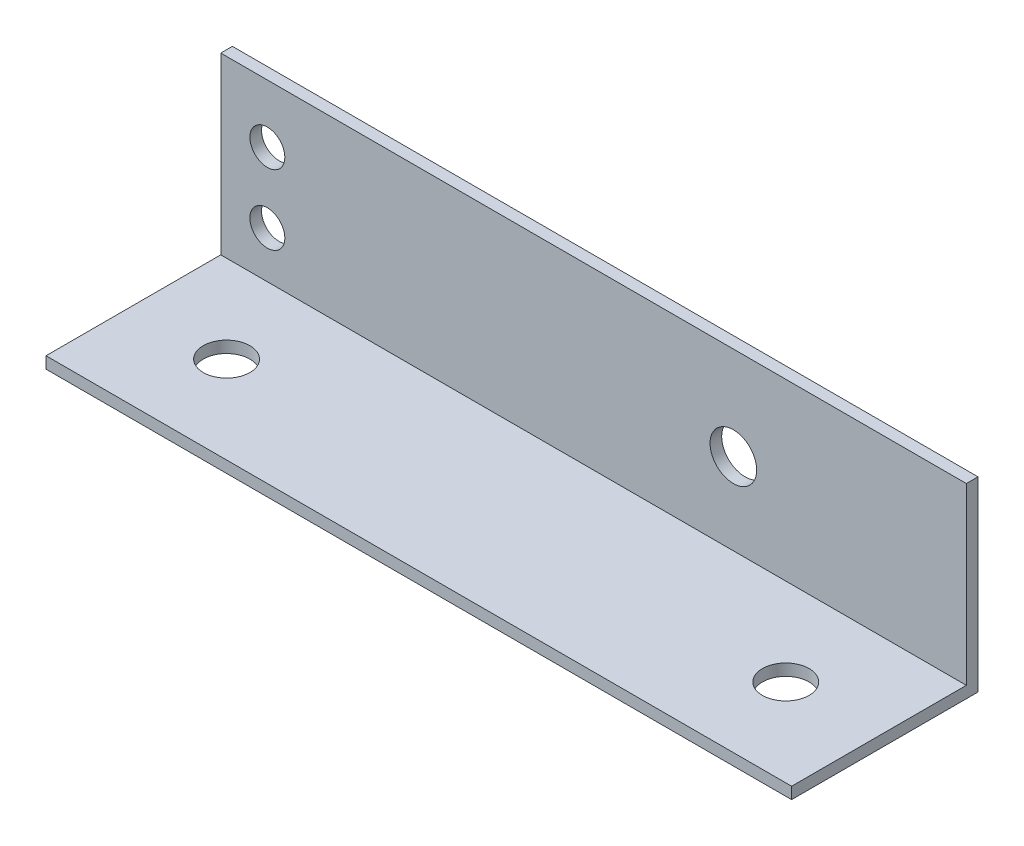
ISO-10303-21;
HEADER;
FILE_DESCRIPTION(('STEP AP214'),'2;1');
FILE_NAME('part.step','',(''),(''),'','','');
FILE_SCHEMA(('AUTOMOTIVE_DESIGN { 1 0 10303 214 1 1 1 1 }'));
ENDSEC;
DATA;
#1=APPLICATION_CONTEXT('core data for automotive mechanical design processes');
#2=APPLICATION_PROTOCOL_DEFINITION('international standard','automotive_design',2000,#1);
#3=PRODUCT_CONTEXT('',#1,'mechanical');
#4=PRODUCT('Part','Part','',(#3));
#5=PRODUCT_RELATED_PRODUCT_CATEGORY('part','',(#4));
#6=PRODUCT_DEFINITION_FORMATION('','',#4);
#7=PRODUCT_DEFINITION_CONTEXT('part definition',#1,'design');
#8=PRODUCT_DEFINITION('design','',#6,#7);
#9=PRODUCT_DEFINITION_SHAPE('','',#8);
#10=(LENGTH_UNIT() NAMED_UNIT(*) SI_UNIT(.MILLI.,.METRE.));
#11=(NAMED_UNIT(*) PLANE_ANGLE_UNIT() SI_UNIT($,.RADIAN.));
#12=(NAMED_UNIT(*) SI_UNIT($,.STERADIAN.) SOLID_ANGLE_UNIT());
#13=UNCERTAINTY_MEASURE_WITH_UNIT(LENGTH_MEASURE(1.E-05),#10,'distance_accuracy_value','');
#14=(GEOMETRIC_REPRESENTATION_CONTEXT(3) GLOBAL_UNCERTAINTY_ASSIGNED_CONTEXT((#13)) GLOBAL_UNIT_ASSIGNED_CONTEXT((#10,
#11,#12)) REPRESENTATION_CONTEXT('',''));
#15=CARTESIAN_POINT('',(0.,0.,0.));
#16=DIRECTION('',(0.,0.,1.));
#17=DIRECTION('',(1.,0.,0.));
#18=AXIS2_PLACEMENT_3D('',#15,#16,#17);
#19=CARTESIAN_POINT('',(101.6,0.,25.4));
#20=DIRECTION('',(0.,1.,0.));
#21=DIRECTION('',(0.,0.,1.));
#22=AXIS2_PLACEMENT_3D('',#19,#20,#21);
#23=PLANE('',#22);
#24=CARTESIAN_POINT('',(12.7,0.,13.49375));
#25=DIRECTION('',(0.,1.,0.));
#26=DIRECTION('',(0.,0.,1.));
#27=AXIS2_PLACEMENT_3D('',#24,#25,#26);
#28=CIRCLE('',#27,3.175);
#29=CARTESIAN_POINT('',(12.7,0.,16.66875));
#30=VERTEX_POINT('',#29);
#31=EDGE_CURVE('E124',#30,#30,#28,.T.);
#32=ORIENTED_EDGE('',*,*,#31,.T.);
#33=EDGE_LOOP('',(#32));
#34=FACE_BOUND('',#33,.T.);
#35=CARTESIAN_POINT('',(88.9,0.,13.49375));
#36=DIRECTION('',(0.,1.,0.));
#37=DIRECTION('',(0.,0.,1.));
#38=AXIS2_PLACEMENT_3D('',#35,#36,#37);
#39=CIRCLE('',#38,3.175);
#40=CARTESIAN_POINT('',(88.9,0.,16.66875));
#41=VERTEX_POINT('',#40);
#42=EDGE_CURVE('E167',#41,#41,#39,.T.);
#43=ORIENTED_EDGE('',*,*,#42,.T.);
#44=EDGE_LOOP('',(#43));
#45=FACE_BOUND('',#44,.T.);
#46=DIRECTION('',(0.,0.,-1.));
#47=VECTOR('',#46,1.);
#48=CARTESIAN_POINT('',(0.,0.,25.4));
#49=LINE('',#48,#47);
#50=CARTESIAN_POINT('',(0.,0.,25.4));
#51=VERTEX_POINT('',#50);
#52=CARTESIAN_POINT('',(0.,0.,0.));
#53=VERTEX_POINT('',#52);
#54=EDGE_CURVE('E120',#51,#53,#49,.T.);
#55=ORIENTED_EDGE('',*,*,#54,.T.);
#56=DIRECTION('',(-1.,0.,0.));
#57=VECTOR('',#56,1.);
#58=CARTESIAN_POINT('',(101.6,0.,0.));
#59=LINE('',#58,#57);
#60=CARTESIAN_POINT('',(101.6,0.,0.));
#61=VERTEX_POINT('',#60);
#62=EDGE_CURVE('E11',#61,#53,#59,.T.);
#63=ORIENTED_EDGE('',*,*,#62,.F.);
#64=DIRECTION('',(0.,0.,-1.));
#65=VECTOR('',#64,1.);
#66=CARTESIAN_POINT('',(101.6,0.,25.4));
#67=LINE('',#66,#65);
#68=CARTESIAN_POINT('',(101.6,0.,25.4));
#69=VERTEX_POINT('',#68);
#70=EDGE_CURVE('E131',#69,#61,#67,.T.);
#71=ORIENTED_EDGE('',*,*,#70,.F.);
#72=DIRECTION('',(-1.,0.,0.));
#73=VECTOR('',#72,1.);
#74=CARTESIAN_POINT('',(101.6,0.,25.4));
#75=LINE('',#74,#73);
#76=EDGE_CURVE('E116',#69,#51,#75,.T.);
#77=ORIENTED_EDGE('',*,*,#76,.T.);
#78=EDGE_LOOP('',(#55,#63,#71,#77));
#79=FACE_BOUND('',#78,.T.);
#80=ADVANCED_FACE('F36',(#34,#45,#79),#23,.F.);
#81=CARTESIAN_POINT('',(101.6,0.,0.));
#82=DIRECTION('',(0.,0.,1.));
#83=DIRECTION('',(1.,0.,0.));
#84=AXIS2_PLACEMENT_3D('',#81,#82,#83);
#85=PLANE('',#84);
#86=CARTESIAN_POINT('',(69.85,12.7,0.));
#87=DIRECTION('',(0.,0.,1.));
#88=DIRECTION('',(1.,0.,0.));
#89=AXIS2_PLACEMENT_3D('',#86,#87,#88);
#90=CIRCLE('',#89,3.175);
#91=CARTESIAN_POINT('',(73.025,12.7,0.));
#92=VERTEX_POINT('',#91);
#93=EDGE_CURVE('E179',#92,#92,#90,.T.);
#94=ORIENTED_EDGE('',*,*,#93,.T.);
#95=EDGE_LOOP('',(#94));
#96=FACE_BOUND('',#95,.T.);
#97=CARTESIAN_POINT('',(6.35,17.4625,0.));
#98=DIRECTION('',(0.,0.,1.));
#99=DIRECTION('',(1.,0.,0.));
#100=AXIS2_PLACEMENT_3D('',#97,#98,#99);
#101=CIRCLE('',#100,2.38125);
#102=CARTESIAN_POINT('',(8.73125,17.4625,0.));
#103=VERTEX_POINT('',#102);
#104=EDGE_CURVE('E183',#103,#103,#101,.T.);
#105=ORIENTED_EDGE('',*,*,#104,.T.);
#106=EDGE_LOOP('',(#105));
#107=FACE_BOUND('',#106,.T.);
#108=CARTESIAN_POINT('',(6.35,7.9375,0.));
#109=DIRECTION('',(0.,0.,1.));
#110=DIRECTION('',(1.,0.,0.));
#111=AXIS2_PLACEMENT_3D('',#108,#109,#110);
#112=CIRCLE('',#111,2.38125);
#113=CARTESIAN_POINT('',(8.73125,7.9375,0.));
#114=VERTEX_POINT('',#113);
#115=EDGE_CURVE('E186',#114,#114,#112,.T.);
#116=ORIENTED_EDGE('',*,*,#115,.T.);
#117=EDGE_LOOP('',(#116));
#118=FACE_BOUND('',#117,.T.);
#119=DIRECTION('',(0.,1.,0.));
#120=VECTOR('',#119,1.);
#121=CARTESIAN_POINT('',(0.,0.,0.));
#122=LINE('',#121,#120);
#123=CARTESIAN_POINT('',(0.,25.4,0.));
#124=VERTEX_POINT('',#123);
#125=EDGE_CURVE('E123',#53,#124,#122,.T.);
#126=ORIENTED_EDGE('',*,*,#125,.T.);
#127=DIRECTION('',(-1.,0.,0.));
#128=VECTOR('',#127,1.);
#129=CARTESIAN_POINT('',(101.6,25.4,0.));
#130=LINE('',#129,#128);
#131=CARTESIAN_POINT('',(101.6,25.4,0.));
#132=VERTEX_POINT('',#131);
#133=EDGE_CURVE('E44',#132,#124,#130,.T.);
#134=ORIENTED_EDGE('',*,*,#133,.F.);
#135=DIRECTION('',(0.,1.,0.));
#136=VECTOR('',#135,1.);
#137=CARTESIAN_POINT('',(101.6,0.,0.));
#138=LINE('',#137,#136);
#139=EDGE_CURVE('E89',#61,#132,#138,.T.);
#140=ORIENTED_EDGE('',*,*,#139,.F.);
#141=ORIENTED_EDGE('',*,*,#62,.T.);
#142=EDGE_LOOP('',(#126,#134,#140,#141));
#143=FACE_BOUND('',#142,.T.);
#144=ADVANCED_FACE('F156',(#96,#107,#118,#143),#85,.F.);
#145=CARTESIAN_POINT('',(101.6,25.4,0.));
#146=DIRECTION('',(0.,-1.,0.));
#147=DIRECTION('',(0.,0.,-1.));
#148=AXIS2_PLACEMENT_3D('',#145,#146,#147);
#149=PLANE('',#148);
#150=DIRECTION('',(0.,0.,1.));
#151=VECTOR('',#150,1.);
#152=CARTESIAN_POINT('',(0.,25.4,0.));
#153=LINE('',#152,#151);
#154=CARTESIAN_POINT('',(0.,25.4,1.5875));
#155=VERTEX_POINT('',#154);
#156=EDGE_CURVE('E126',#124,#155,#153,.T.);
#157=ORIENTED_EDGE('',*,*,#156,.T.);
#158=DIRECTION('',(-1.,0.,0.));
#159=VECTOR('',#158,1.);
#160=CARTESIAN_POINT('',(101.6,25.4,1.5875));
#161=LINE('',#160,#159);
#162=CARTESIAN_POINT('',(101.6,25.4,1.5875));
#163=VERTEX_POINT('',#162);
#164=EDGE_CURVE('E111',#163,#155,#161,.T.);
#165=ORIENTED_EDGE('',*,*,#164,.F.);
#166=DIRECTION('',(0.,0.,1.));
#167=VECTOR('',#166,1.);
#168=CARTESIAN_POINT('',(101.6,25.4,0.));
#169=LINE('',#168,#167);
#170=EDGE_CURVE('E102',#132,#163,#169,.T.);
#171=ORIENTED_EDGE('',*,*,#170,.F.);
#172=ORIENTED_EDGE('',*,*,#133,.T.);
#173=EDGE_LOOP('',(#157,#165,#171,#172));
#174=FACE_BOUND('',#173,.T.);
#175=ADVANCED_FACE('F137',(#174),#149,.F.);
#176=CARTESIAN_POINT('',(101.6,25.4,1.5875));
#177=DIRECTION('',(0.,0.,-1.));
#178=DIRECTION('',(0.,1.,0.));
#179=AXIS2_PLACEMENT_3D('',#176,#177,#178);
#180=PLANE('',#179);
#181=CARTESIAN_POINT('',(69.85,12.7,1.5875));
#182=DIRECTION('',(0.,0.,1.));
#183=DIRECTION('',(1.,0.,0.));
#184=AXIS2_PLACEMENT_3D('',#181,#182,#183);
#185=CIRCLE('',#184,3.175);
#186=CARTESIAN_POINT('',(73.025,12.7,1.5875));
#187=VERTEX_POINT('',#186);
#188=EDGE_CURVE('E189',#187,#187,#185,.T.);
#189=ORIENTED_EDGE('',*,*,#188,.F.);
#190=EDGE_LOOP('',(#189));
#191=FACE_BOUND('',#190,.T.);
#192=CARTESIAN_POINT('',(6.35,17.4625,1.5875));
#193=DIRECTION('',(0.,0.,1.));
#194=DIRECTION('',(1.,0.,0.));
#195=AXIS2_PLACEMENT_3D('',#192,#193,#194);
#196=CIRCLE('',#195,2.38125);
#197=CARTESIAN_POINT('',(8.73125,17.4625,1.5875));
#198=VERTEX_POINT('',#197);
#199=EDGE_CURVE('E193',#198,#198,#196,.T.);
#200=ORIENTED_EDGE('',*,*,#199,.F.);
#201=EDGE_LOOP('',(#200));
#202=FACE_BOUND('',#201,.T.);
#203=CARTESIAN_POINT('',(6.35,7.9375,1.5875));
#204=DIRECTION('',(0.,0.,1.));
#205=DIRECTION('',(1.,0.,0.));
#206=AXIS2_PLACEMENT_3D('',#203,#204,#205);
#207=CIRCLE('',#206,2.38125);
#208=CARTESIAN_POINT('',(8.73125,7.9375,1.5875));
#209=VERTEX_POINT('',#208);
#210=EDGE_CURVE('E190',#209,#209,#207,.T.);
#211=ORIENTED_EDGE('',*,*,#210,.F.);
#212=EDGE_LOOP('',(#211));
#213=FACE_BOUND('',#212,.T.);
#214=DIRECTION('',(0.,-1.,0.));
#215=VECTOR('',#214,1.);
#216=CARTESIAN_POINT('',(0.,25.4,1.5875));
#217=LINE('',#216,#215);
#218=CARTESIAN_POINT('',(0.,1.5875,1.5875));
#219=VERTEX_POINT('',#218);
#220=EDGE_CURVE('E110',#155,#219,#217,.T.);
#221=ORIENTED_EDGE('',*,*,#220,.T.);
#222=DIRECTION('',(-1.,0.,0.));
#223=VECTOR('',#222,1.);
#224=CARTESIAN_POINT('',(101.6,1.5875,1.5875));
#225=LINE('',#224,#223);
#226=CARTESIAN_POINT('',(101.6,1.5875,1.5875));
#227=VERTEX_POINT('',#226);
#228=EDGE_CURVE('E107',#227,#219,#225,.T.);
#229=ORIENTED_EDGE('',*,*,#228,.F.);
#230=DIRECTION('',(0.,-1.,0.));
#231=VECTOR('',#230,1.);
#232=CARTESIAN_POINT('',(101.6,25.4,1.5875));
#233=LINE('',#232,#231);
#234=EDGE_CURVE('E96',#163,#227,#233,.T.);
#235=ORIENTED_EDGE('',*,*,#234,.F.);
#236=ORIENTED_EDGE('',*,*,#164,.T.);
#237=EDGE_LOOP('',(#221,#229,#235,#236));
#238=FACE_BOUND('',#237,.T.);
#239=ADVANCED_FACE('F108',(#191,#202,#213,#238),#180,.F.);
#240=CARTESIAN_POINT('',(101.6,1.5875,1.5875));
#241=DIRECTION('',(0.,-1.,0.));
#242=DIRECTION('',(0.,0.,-1.));
#243=AXIS2_PLACEMENT_3D('',#240,#241,#242);
#244=PLANE('',#243);
#245=CARTESIAN_POINT('',(12.7,1.5875,13.49375));
#246=DIRECTION('',(0.,1.,0.));
#247=DIRECTION('',(0.,0.,1.));
#248=AXIS2_PLACEMENT_3D('',#245,#246,#247);
#249=CIRCLE('',#248,3.175);
#250=CARTESIAN_POINT('',(12.7,1.5875,16.66875));
#251=VERTEX_POINT('',#250);
#252=EDGE_CURVE('E169',#251,#251,#249,.T.);
#253=ORIENTED_EDGE('',*,*,#252,.F.);
#254=EDGE_LOOP('',(#253));
#255=FACE_BOUND('',#254,.T.);
#256=CARTESIAN_POINT('',(88.9,1.5875,13.49375));
#257=DIRECTION('',(0.,1.,0.));
#258=DIRECTION('',(0.,0.,1.));
#259=AXIS2_PLACEMENT_3D('',#256,#257,#258);
#260=CIRCLE('',#259,3.175);
#261=CARTESIAN_POINT('',(88.9,1.5875,16.66875));
#262=VERTEX_POINT('',#261);
#263=EDGE_CURVE('E173',#262,#262,#260,.T.);
#264=ORIENTED_EDGE('',*,*,#263,.F.);
#265=EDGE_LOOP('',(#264));
#266=FACE_BOUND('',#265,.T.);
#267=DIRECTION('',(0.,0.,1.));
#268=VECTOR('',#267,1.);
#269=CARTESIAN_POINT('',(0.,1.5875,1.5875));
#270=LINE('',#269,#268);
#271=CARTESIAN_POINT('',(0.,1.5875,25.4));
#272=VERTEX_POINT('',#271);
#273=EDGE_CURVE('E75',#219,#272,#270,.T.);
#274=ORIENTED_EDGE('',*,*,#273,.T.);
#275=DIRECTION('',(-1.,0.,0.));
#276=VECTOR('',#275,1.);
#277=CARTESIAN_POINT('',(101.6,1.5875,25.4));
#278=LINE('',#277,#276);
#279=CARTESIAN_POINT('',(101.6,1.5875,25.4));
#280=VERTEX_POINT('',#279);
#281=EDGE_CURVE('E112',#280,#272,#278,.T.);
#282=ORIENTED_EDGE('',*,*,#281,.F.);
#283=DIRECTION('',(0.,0.,1.));
#284=VECTOR('',#283,1.);
#285=CARTESIAN_POINT('',(101.6,1.5875,1.5875));
#286=LINE('',#285,#284);
#287=EDGE_CURVE('E100',#227,#280,#286,.T.);
#288=ORIENTED_EDGE('',*,*,#287,.F.);
#289=ORIENTED_EDGE('',*,*,#228,.T.);
#290=EDGE_LOOP('',(#274,#282,#288,#289));
#291=FACE_BOUND('',#290,.T.);
#292=ADVANCED_FACE('F114',(#255,#266,#291),#244,.F.);
#293=CARTESIAN_POINT('',(101.6,1.5875,25.4));
#294=DIRECTION('',(0.,0.,-1.));
#295=DIRECTION('',(-1.,0.,0.));
#296=AXIS2_PLACEMENT_3D('',#293,#294,#295);
#297=PLANE('',#296);
#298=DIRECTION('',(0.,-1.,0.));
#299=VECTOR('',#298,1.);
#300=CARTESIAN_POINT('',(0.,1.5875,25.4));
#301=LINE('',#300,#299);
#302=EDGE_CURVE('E81',#272,#51,#301,.T.);
#303=ORIENTED_EDGE('',*,*,#302,.T.);
#304=ORIENTED_EDGE('',*,*,#76,.F.);
#305=DIRECTION('',(0.,-1.,0.));
#306=VECTOR('',#305,1.);
#307=CARTESIAN_POINT('',(101.6,1.5875,25.4));
#308=LINE('',#307,#306);
#309=EDGE_CURVE('E52',#280,#69,#308,.T.);
#310=ORIENTED_EDGE('',*,*,#309,.F.);
#311=ORIENTED_EDGE('',*,*,#281,.T.);
#312=EDGE_LOOP('',(#303,#304,#310,#311));
#313=FACE_BOUND('',#312,.T.);
#314=ADVANCED_FACE('F144',(#313),#297,.F.);
#315=CARTESIAN_POINT('',(101.6,0.,0.));
#316=DIRECTION('',(1.,0.,0.));
#317=DIRECTION('',(0.,0.,-1.));
#318=AXIS2_PLACEMENT_3D('',#315,#316,#317);
#319=PLANE('',#318);
#320=ORIENTED_EDGE('',*,*,#70,.T.);
#321=ORIENTED_EDGE('',*,*,#139,.T.);
#322=ORIENTED_EDGE('',*,*,#170,.T.);
#323=ORIENTED_EDGE('',*,*,#234,.T.);
#324=ORIENTED_EDGE('',*,*,#287,.T.);
#325=ORIENTED_EDGE('',*,*,#309,.T.);
#326=EDGE_LOOP('',(#320,#321,#322,#323,#324,#325));
#327=FACE_BOUND('',#326,.T.);
#328=ADVANCED_FACE('F98',(#327),#319,.T.);
#329=CARTESIAN_POINT('',(0.,0.,0.));
#330=DIRECTION('',(1.,0.,0.));
#331=DIRECTION('',(0.,0.,-1.));
#332=AXIS2_PLACEMENT_3D('',#329,#330,#331);
#333=PLANE('',#332);
#334=ORIENTED_EDGE('',*,*,#54,.F.);
#335=ORIENTED_EDGE('',*,*,#302,.F.);
#336=ORIENTED_EDGE('',*,*,#273,.F.);
#337=ORIENTED_EDGE('',*,*,#220,.F.);
#338=ORIENTED_EDGE('',*,*,#156,.F.);
#339=ORIENTED_EDGE('',*,*,#125,.F.);
#340=EDGE_LOOP('',(#334,#335,#336,#337,#338,#339));
#341=FACE_BOUND('',#340,.T.);
#342=ADVANCED_FACE('F140',(#341),#333,.F.);
#343=CARTESIAN_POINT('',(88.9,-100.0125,13.49375));
#344=DIRECTION('',(0.,1.,0.));
#345=DIRECTION('',(0.,0.,1.));
#346=AXIS2_PLACEMENT_3D('',#343,#344,#345);
#347=CYLINDRICAL_SURFACE('',#346,3.175);
#348=ORIENTED_EDGE('',*,*,#263,.T.);
#349=EDGE_LOOP('',(#348));
#350=FACE_BOUND('',#349,.T.);
#351=ORIENTED_EDGE('',*,*,#42,.F.);
#352=EDGE_LOOP('',(#351));
#353=FACE_BOUND('',#352,.T.);
#354=ADVANCED_FACE('F223',(#350,#353),#347,.F.);
#355=CARTESIAN_POINT('',(12.7,-100.0125,13.49375));
#356=DIRECTION('',(0.,1.,0.));
#357=DIRECTION('',(0.,0.,1.));
#358=AXIS2_PLACEMENT_3D('',#355,#356,#357);
#359=CYLINDRICAL_SURFACE('',#358,3.175);
#360=ORIENTED_EDGE('',*,*,#252,.T.);
#361=EDGE_LOOP('',(#360));
#362=FACE_BOUND('',#361,.T.);
#363=ORIENTED_EDGE('',*,*,#31,.F.);
#364=EDGE_LOOP('',(#363));
#365=FACE_BOUND('',#364,.T.);
#366=ADVANCED_FACE('F213',(#362,#365),#359,.F.);
#367=CARTESIAN_POINT('',(6.35,7.9375,-100.0125));
#368=DIRECTION('',(0.,0.,1.));
#369=DIRECTION('',(1.,0.,0.));
#370=AXIS2_PLACEMENT_3D('',#367,#368,#369);
#371=CYLINDRICAL_SURFACE('',#370,2.38125);
#372=ORIENTED_EDGE('',*,*,#210,.T.);
#373=EDGE_LOOP('',(#372));
#374=FACE_BOUND('',#373,.T.);
#375=ORIENTED_EDGE('',*,*,#115,.F.);
#376=EDGE_LOOP('',(#375));
#377=FACE_BOUND('',#376,.T.);
#378=ADVANCED_FACE('F209',(#374,#377),#371,.F.);
#379=CARTESIAN_POINT('',(6.35,17.4625,-100.0125));
#380=DIRECTION('',(0.,0.,1.));
#381=DIRECTION('',(1.,0.,0.));
#382=AXIS2_PLACEMENT_3D('',#379,#380,#381);
#383=CYLINDRICAL_SURFACE('',#382,2.38125);
#384=ORIENTED_EDGE('',*,*,#199,.T.);
#385=EDGE_LOOP('',(#384));
#386=FACE_BOUND('',#385,.T.);
#387=ORIENTED_EDGE('',*,*,#104,.F.);
#388=EDGE_LOOP('',(#387));
#389=FACE_BOUND('',#388,.T.);
#390=ADVANCED_FACE('F212',(#386,#389),#383,.F.);
#391=CARTESIAN_POINT('',(69.85,12.7,-100.0125));
#392=DIRECTION('',(0.,0.,1.));
#393=DIRECTION('',(1.,0.,0.));
#394=AXIS2_PLACEMENT_3D('',#391,#392,#393);
#395=CYLINDRICAL_SURFACE('',#394,3.175);
#396=ORIENTED_EDGE('',*,*,#188,.T.);
#397=EDGE_LOOP('',(#396));
#398=FACE_BOUND('',#397,.T.);
#399=ORIENTED_EDGE('',*,*,#93,.F.);
#400=EDGE_LOOP('',(#399));
#401=FACE_BOUND('',#400,.T.);
#402=ADVANCED_FACE('F199',(#398,#401),#395,.F.);
#403=CLOSED_SHELL('',(#80,#144,#175,#239,#292,#314,#328,#342,#354,#366,#378,#390,#402));
#404=MANIFOLD_SOLID_BREP('B2',#403);
#405=ADVANCED_BREP_SHAPE_REPRESENTATION('',(#18,#404),#14);
#406=SHAPE_DEFINITION_REPRESENTATION(#9,#405);
ENDSEC;
END-ISO-10303-21;
